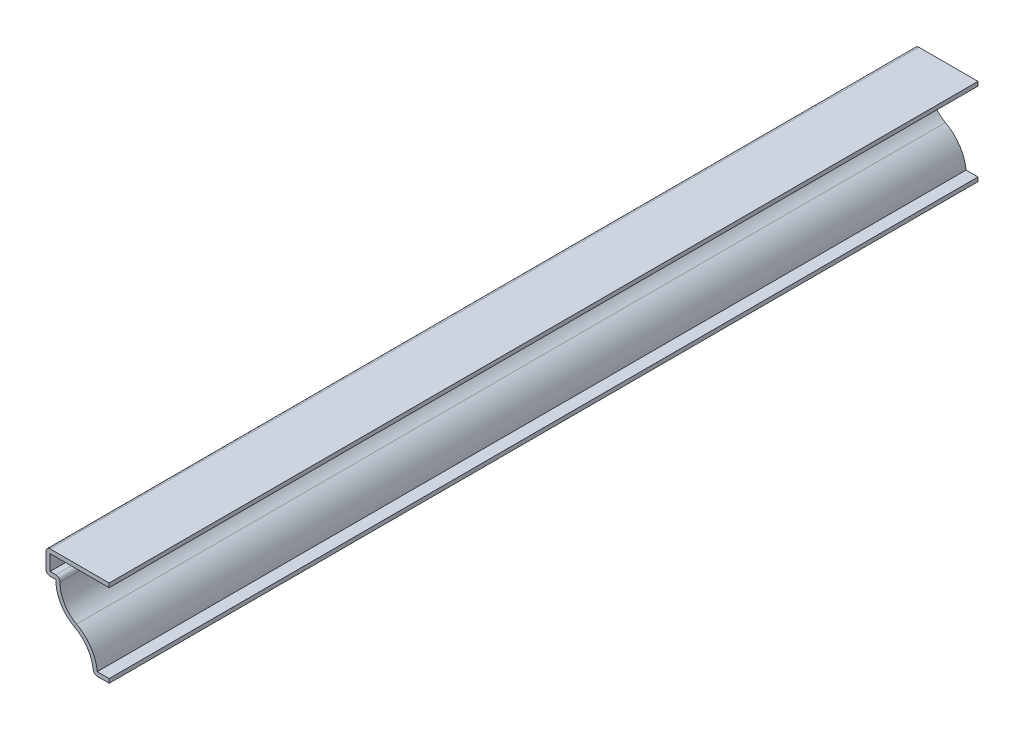
ISO-10303-21;
HEADER;
FILE_DESCRIPTION(('STEP AP214'),'2;1');
FILE_NAME('part.step','',(''),(''),'','','');
FILE_SCHEMA(('AUTOMOTIVE_DESIGN { 1 0 10303 214 1 1 1 1 }'));
ENDSEC;
DATA;
#1=APPLICATION_CONTEXT('core data for automotive mechanical design processes');
#2=APPLICATION_PROTOCOL_DEFINITION('international standard','automotive_design',2000,#1);
#3=PRODUCT_CONTEXT('',#1,'mechanical');
#4=PRODUCT('Part','Part','',(#3));
#5=PRODUCT_RELATED_PRODUCT_CATEGORY('part','',(#4));
#6=PRODUCT_DEFINITION_FORMATION('','',#4);
#7=PRODUCT_DEFINITION_CONTEXT('part definition',#1,'design');
#8=PRODUCT_DEFINITION('design','',#6,#7);
#9=PRODUCT_DEFINITION_SHAPE('','',#8);
#10=(LENGTH_UNIT() NAMED_UNIT(*) SI_UNIT(.MILLI.,.METRE.));
#11=(NAMED_UNIT(*) PLANE_ANGLE_UNIT() SI_UNIT($,.RADIAN.));
#12=(NAMED_UNIT(*) SI_UNIT($,.STERADIAN.) SOLID_ANGLE_UNIT());
#13=UNCERTAINTY_MEASURE_WITH_UNIT(LENGTH_MEASURE(1.E-05),#10,'distance_accuracy_value','');
#14=(GEOMETRIC_REPRESENTATION_CONTEXT(3) GLOBAL_UNCERTAINTY_ASSIGNED_CONTEXT((#13)) GLOBAL_UNIT_ASSIGNED_CONTEXT((#10,
#11,#12)) REPRESENTATION_CONTEXT('',''));
#15=CARTESIAN_POINT('',(0.,0.,0.));
#16=DIRECTION('',(0.,0.,1.));
#17=DIRECTION('',(1.,0.,0.));
#18=AXIS2_PLACEMENT_3D('',#15,#16,#17);
#19=CARTESIAN_POINT('',(0.,0.,-349.25));
#20=DIRECTION('',(0.,-1.,0.));
#21=DIRECTION('',(0.,0.,-1.));
#22=AXIS2_PLACEMENT_3D('',#19,#20,#21);
#23=PLANE('',#22);
#24=DIRECTION('',(1.,0.,0.));
#25=VECTOR('',#24,1.);
#26=CARTESIAN_POINT('',(0.,0.,0.));
#27=LINE('',#26,#25);
#28=CARTESIAN_POINT('',(-4.78474057931869,0.,0.));
#29=VERTEX_POINT('',#28);
#30=CARTESIAN_POINT('',(0.,0.,0.));
#31=VERTEX_POINT('',#30);
#32=EDGE_CURVE('E294',#29,#31,#27,.T.);
#33=ORIENTED_EDGE('',*,*,#32,.F.);
#34=DIRECTION('',(0.,0.,1.));
#35=VECTOR('',#34,1.);
#36=CARTESIAN_POINT('',(-4.78474057931869,0.,-349.25));
#37=LINE('',#36,#35);
#38=CARTESIAN_POINT('',(-4.78474057931869,0.,-349.25));
#39=VERTEX_POINT('',#38);
#40=EDGE_CURVE('E169',#29,#39,#37,.F.);
#41=ORIENTED_EDGE('',*,*,#40,.T.);
#42=DIRECTION('',(1.,0.,0.));
#43=VECTOR('',#42,1.);
#44=CARTESIAN_POINT('',(0.,0.,-349.25));
#45=LINE('',#44,#43);
#46=CARTESIAN_POINT('',(0.,0.,-349.25));
#47=VERTEX_POINT('',#46);
#48=EDGE_CURVE('E162',#39,#47,#45,.T.);
#49=ORIENTED_EDGE('',*,*,#48,.T.);
#50=DIRECTION('',(0.,0.,1.));
#51=VECTOR('',#50,1.);
#52=CARTESIAN_POINT('',(0.,0.,-349.25));
#53=LINE('',#52,#51);
#54=EDGE_CURVE('E166',#47,#31,#53,.T.);
#55=ORIENTED_EDGE('',*,*,#54,.T.);
#56=EDGE_LOOP('',(#33,#41,#49,#55));
#57=FACE_BOUND('',#56,.T.);
#58=ADVANCED_FACE('F35',(#57),#23,.T.);
#59=CARTESIAN_POINT('',(-20.6375,0.,-349.25));
#60=DIRECTION('',(0.,0.,1.));
#61=DIRECTION('',(1.,0.,0.));
#62=AXIS2_PLACEMENT_3D('',#59,#60,#61);
#63=CYLINDRICAL_SURFACE('',#62,14.2875);
#64=CARTESIAN_POINT('',(-20.6375,0.,-349.25));
#65=DIRECTION('',(0.,0.,-1.));
#66=DIRECTION('',(1.,0.,0.));
#67=AXIS2_PLACEMENT_3D('',#64,#65,#66);
#68=CIRCLE('',#67,14.2875);
#69=CARTESIAN_POINT('',(-13.8914032392858,12.5945557581473,-349.25));
#70=VERTEX_POINT('',#69);
#71=CARTESIAN_POINT('',(-6.42685908504664,1.47998007968127,-349.25));
#72=VERTEX_POINT('',#71);
#73=EDGE_CURVE('E186',#70,#72,#68,.T.);
#74=ORIENTED_EDGE('',*,*,#73,.T.);
#75=DIRECTION('',(0.,0.,1.));
#76=VECTOR('',#75,1.);
#77=CARTESIAN_POINT('',(-6.42685908504664,1.47998007968127,-349.25));
#78=LINE('',#77,#76);
#79=CARTESIAN_POINT('',(-6.42685908504664,1.47998007968127,0.));
#80=VERTEX_POINT('',#79);
#81=EDGE_CURVE('E195',#72,#80,#78,.T.);
#82=ORIENTED_EDGE('',*,*,#81,.T.);
#83=CARTESIAN_POINT('',(-20.6375,0.,0.));
#84=DIRECTION('',(0.,0.,-1.));
#85=DIRECTION('',(1.,0.,0.));
#86=AXIS2_PLACEMENT_3D('',#83,#84,#85);
#87=CIRCLE('',#86,14.2875);
#88=CARTESIAN_POINT('',(-13.8914032392858,12.5945557581473,0.));
#89=VERTEX_POINT('',#88);
#90=EDGE_CURVE('E172',#89,#80,#87,.T.);
#91=ORIENTED_EDGE('',*,*,#90,.F.);
#92=DIRECTION('',(0.,0.,1.));
#93=VECTOR('',#92,1.);
#94=CARTESIAN_POINT('',(-13.8914032392858,12.5945557581473,-349.25));
#95=LINE('',#94,#93);
#96=EDGE_CURVE('E199',#70,#89,#95,.T.);
#97=ORIENTED_EDGE('',*,*,#96,.F.);
#98=EDGE_LOOP('',(#74,#82,#91,#97));
#99=FACE_BOUND('',#98,.T.);
#100=ADVANCED_FACE('F343',(#99),#63,.F.);
#101=CARTESIAN_POINT('',(-7.14530647857166,25.1891115162946,-349.25));
#102=DIRECTION('',(0.,0.,1.));
#103=DIRECTION('',(1.,0.,0.));
#104=AXIS2_PLACEMENT_3D('',#101,#102,#103);
#105=CYLINDRICAL_SURFACE('',#104,14.2875);
#106=CARTESIAN_POINT('',(-7.14530647857166,25.1891115162946,0.));
#107=DIRECTION('',(0.,0.,1.));
#108=DIRECTION('',(-1.,0.,0.));
#109=AXIS2_PLACEMENT_3D('',#106,#107,#108);
#110=CIRCLE('',#109,14.2875);
#111=CARTESIAN_POINT('',(-21.43125,25.4,0.));
#112=VERTEX_POINT('',#111);
#113=EDGE_CURVE('E255',#112,#89,#110,.T.);
#114=ORIENTED_EDGE('',*,*,#113,.F.);
#115=DIRECTION('',(0.,0.,1.));
#116=VECTOR('',#115,1.);
#117=CARTESIAN_POINT('',(-21.43125,25.4,-349.25));
#118=LINE('',#117,#116);
#119=CARTESIAN_POINT('',(-21.43125,25.4,-349.25));
#120=VERTEX_POINT('',#119);
#121=EDGE_CURVE('E265',#120,#112,#118,.T.);
#122=ORIENTED_EDGE('',*,*,#121,.F.);
#123=CARTESIAN_POINT('',(-7.14530647857166,25.1891115162946,-349.25));
#124=DIRECTION('',(0.,0.,1.));
#125=DIRECTION('',(-1.,0.,0.));
#126=AXIS2_PLACEMENT_3D('',#123,#124,#125);
#127=CIRCLE('',#126,14.2875);
#128=EDGE_CURVE('E191',#120,#70,#127,.T.);
#129=ORIENTED_EDGE('',*,*,#128,.T.);
#130=ORIENTED_EDGE('',*,*,#96,.T.);
#131=EDGE_LOOP('',(#114,#122,#129,#130));
#132=FACE_BOUND('',#131,.T.);
#133=ADVANCED_FACE('F347',(#132),#105,.T.);
#134=CARTESIAN_POINT('',(-25.4,25.4,-349.25));
#135=DIRECTION('',(0.,-1.,0.));
#136=DIRECTION('',(1.,0.,0.));
#137=AXIS2_PLACEMENT_3D('',#134,#135,#136);
#138=PLANE('',#137);
#139=DIRECTION('',(1.,0.,0.));
#140=VECTOR('',#139,1.);
#141=CARTESIAN_POINT('',(-25.4,25.4,0.));
#142=LINE('',#141,#140);
#143=CARTESIAN_POINT('',(-23.749,25.4,0.));
#144=VERTEX_POINT('',#143);
#145=EDGE_CURVE('E231',#144,#112,#142,.T.);
#146=ORIENTED_EDGE('',*,*,#145,.F.);
#147=DIRECTION('',(0.,0.,1.));
#148=VECTOR('',#147,1.);
#149=CARTESIAN_POINT('',(-23.749,25.4,-349.25));
#150=LINE('',#149,#148);
#151=CARTESIAN_POINT('',(-23.749,25.4,-349.25));
#152=VERTEX_POINT('',#151);
#153=EDGE_CURVE('E43',#144,#152,#150,.F.);
#154=ORIENTED_EDGE('',*,*,#153,.T.);
#155=DIRECTION('',(1.,0.,0.));
#156=VECTOR('',#155,1.);
#157=CARTESIAN_POINT('',(-25.4,25.4,-349.25));
#158=LINE('',#157,#156);
#159=EDGE_CURVE('E229',#152,#120,#158,.T.);
#160=ORIENTED_EDGE('',*,*,#159,.T.);
#161=ORIENTED_EDGE('',*,*,#121,.T.);
#162=EDGE_LOOP('',(#146,#154,#160,#161));
#163=FACE_BOUND('',#162,.T.);
#164=ADVANCED_FACE('F227',(#163),#138,.T.);
#165=CARTESIAN_POINT('',(-25.4,34.925,-349.25));
#166=DIRECTION('',(-1.,0.,0.));
#167=DIRECTION('',(0.,0.,1.));
#168=AXIS2_PLACEMENT_3D('',#165,#166,#167);
#169=PLANE('',#168);
#170=DIRECTION('',(0.,-1.,0.));
#171=VECTOR('',#170,1.);
#172=CARTESIAN_POINT('',(-25.4,34.925,-349.25));
#173=LINE('',#172,#171);
#174=CARTESIAN_POINT('',(-25.4,33.274,-349.25));
#175=VERTEX_POINT('',#174);
#176=CARTESIAN_POINT('',(-25.4,27.051,-349.25));
#177=VERTEX_POINT('',#176);
#178=EDGE_CURVE('E239',#175,#177,#173,.T.);
#179=ORIENTED_EDGE('',*,*,#178,.T.);
#180=DIRECTION('',(0.,0.,1.));
#181=VECTOR('',#180,1.);
#182=CARTESIAN_POINT('',(-25.4,27.051,-349.25));
#183=LINE('',#182,#181);
#184=CARTESIAN_POINT('',(-25.4,27.051,0.));
#185=VERTEX_POINT('',#184);
#186=EDGE_CURVE('E221',#177,#185,#183,.T.);
#187=ORIENTED_EDGE('',*,*,#186,.T.);
#188=DIRECTION('',(0.,-1.,0.));
#189=VECTOR('',#188,1.);
#190=CARTESIAN_POINT('',(-25.4,34.925,0.));
#191=LINE('',#190,#189);
#192=CARTESIAN_POINT('',(-25.4,33.274,0.));
#193=VERTEX_POINT('',#192);
#194=EDGE_CURVE('E247',#193,#185,#191,.T.);
#195=ORIENTED_EDGE('',*,*,#194,.F.);
#196=DIRECTION('',(0.,0.,1.));
#197=VECTOR('',#196,1.);
#198=CARTESIAN_POINT('',(-25.4,33.274,-349.25));
#199=LINE('',#198,#197);
#200=EDGE_CURVE('E219',#193,#175,#199,.F.);
#201=ORIENTED_EDGE('',*,*,#200,.T.);
#202=EDGE_LOOP('',(#179,#187,#195,#201));
#203=FACE_BOUND('',#202,.T.);
#204=ADVANCED_FACE('F246',(#203),#169,.T.);
#205=CARTESIAN_POINT('',(0.,34.925,-349.25));
#206=DIRECTION('',(0.,1.,0.));
#207=DIRECTION('',(0.,0.,1.));
#208=AXIS2_PLACEMENT_3D('',#205,#206,#207);
#209=PLANE('',#208);
#210=DIRECTION('',(-1.,0.,0.));
#211=VECTOR('',#210,1.);
#212=CARTESIAN_POINT('',(0.,34.925,-349.25));
#213=LINE('',#212,#211);
#214=CARTESIAN_POINT('',(0.,34.925,-349.25));
#215=VERTEX_POINT('',#214);
#216=CARTESIAN_POINT('',(-23.749,34.925,-349.25));
#217=VERTEX_POINT('',#216);
#218=EDGE_CURVE('E335',#215,#217,#213,.T.);
#219=ORIENTED_EDGE('',*,*,#218,.T.);
#220=DIRECTION('',(0.,0.,1.));
#221=VECTOR('',#220,1.);
#222=CARTESIAN_POINT('',(-23.749,34.925,-349.25));
#223=LINE('',#222,#221);
#224=CARTESIAN_POINT('',(-23.749,34.925,0.));
#225=VERTEX_POINT('',#224);
#226=EDGE_CURVE('E11',#217,#225,#223,.T.);
#227=ORIENTED_EDGE('',*,*,#226,.T.);
#228=DIRECTION('',(-1.,0.,0.));
#229=VECTOR('',#228,1.);
#230=CARTESIAN_POINT('',(0.,34.925,0.));
#231=LINE('',#230,#229);
#232=CARTESIAN_POINT('',(0.,34.925,0.));
#233=VERTEX_POINT('',#232);
#234=EDGE_CURVE('E253',#233,#225,#231,.T.);
#235=ORIENTED_EDGE('',*,*,#234,.F.);
#236=DIRECTION('',(0.,0.,1.));
#237=VECTOR('',#236,1.);
#238=CARTESIAN_POINT('',(0.,34.925,-349.25));
#239=LINE('',#238,#237);
#240=EDGE_CURVE('E267',#215,#233,#239,.T.);
#241=ORIENTED_EDGE('',*,*,#240,.F.);
#242=EDGE_LOOP('',(#219,#227,#235,#241));
#243=FACE_BOUND('',#242,.T.);
#244=ADVANCED_FACE('F379',(#243),#209,.T.);
#245=CARTESIAN_POINT('',(0.,34.925,-349.25));
#246=DIRECTION('',(-1.,0.,0.));
#247=DIRECTION('',(0.,0.,1.));
#248=AXIS2_PLACEMENT_3D('',#245,#246,#247);
#249=PLANE('',#248);
#250=DIRECTION('',(0.,-1.,0.));
#251=VECTOR('',#250,1.);
#252=CARTESIAN_POINT('',(0.,34.925,0.));
#253=LINE('',#252,#251);
#254=CARTESIAN_POINT('',(0.,33.274,0.));
#255=VERTEX_POINT('',#254);
#256=EDGE_CURVE('E257',#233,#255,#253,.T.);
#257=ORIENTED_EDGE('',*,*,#256,.T.);
#258=DIRECTION('',(0.,0.,1.));
#259=VECTOR('',#258,1.);
#260=CARTESIAN_POINT('',(0.,33.274,-349.25));
#261=LINE('',#260,#259);
#262=CARTESIAN_POINT('',(0.,33.274,-349.25));
#263=VERTEX_POINT('',#262);
#264=EDGE_CURVE('E269',#263,#255,#261,.T.);
#265=ORIENTED_EDGE('',*,*,#264,.F.);
#266=DIRECTION('',(0.,-1.,0.));
#267=VECTOR('',#266,1.);
#268=CARTESIAN_POINT('',(0.,34.925,-349.25));
#269=LINE('',#268,#267);
#270=EDGE_CURVE('E333',#215,#263,#269,.T.);
#271=ORIENTED_EDGE('',*,*,#270,.F.);
#272=ORIENTED_EDGE('',*,*,#240,.T.);
#273=EDGE_LOOP('',(#257,#265,#271,#272));
#274=FACE_BOUND('',#273,.T.);
#275=ADVANCED_FACE('F307',(#274),#249,.F.);
#276=CARTESIAN_POINT('',(0.,33.274,-349.25));
#277=DIRECTION('',(0.,1.,0.));
#278=DIRECTION('',(0.,0.,1.));
#279=AXIS2_PLACEMENT_3D('',#276,#277,#278);
#280=PLANE('',#279);
#281=DIRECTION('',(1.,0.,0.));
#282=VECTOR('',#281,1.);
#283=CARTESIAN_POINT('',(0.,33.274,0.));
#284=LINE('',#283,#282);
#285=CARTESIAN_POINT('',(-23.749,33.274,0.));
#286=VERTEX_POINT('',#285);
#287=EDGE_CURVE('E303',#255,#286,#284,.F.);
#288=ORIENTED_EDGE('',*,*,#287,.T.);
#289=DIRECTION('',(0.,0.,1.));
#290=VECTOR('',#289,1.);
#291=CARTESIAN_POINT('',(-23.749,33.274,-349.25));
#292=LINE('',#291,#290);
#293=CARTESIAN_POINT('',(-23.749,33.274,-349.25));
#294=VERTEX_POINT('',#293);
#295=EDGE_CURVE('E272',#294,#286,#292,.T.);
#296=ORIENTED_EDGE('',*,*,#295,.F.);
#297=DIRECTION('',(1.,0.,0.));
#298=VECTOR('',#297,1.);
#299=CARTESIAN_POINT('',(0.,33.274,-349.25));
#300=LINE('',#299,#298);
#301=EDGE_CURVE('E315',#263,#294,#300,.F.);
#302=ORIENTED_EDGE('',*,*,#301,.F.);
#303=ORIENTED_EDGE('',*,*,#264,.T.);
#304=EDGE_LOOP('',(#288,#296,#302,#303));
#305=FACE_BOUND('',#304,.T.);
#306=ADVANCED_FACE('F313',(#305),#280,.F.);
#307=CARTESIAN_POINT('',(-23.749,34.925,-349.25));
#308=DIRECTION('',(-1.,0.,0.));
#309=DIRECTION('',(0.,0.,1.));
#310=AXIS2_PLACEMENT_3D('',#307,#308,#309);
#311=PLANE('',#310);
#312=DIRECTION('',(0.,1.,0.));
#313=VECTOR('',#312,1.);
#314=CARTESIAN_POINT('',(-23.749,34.925,0.));
#315=LINE('',#314,#313);
#316=CARTESIAN_POINT('',(-23.749,27.051,0.));
#317=VERTEX_POINT('',#316);
#318=EDGE_CURVE('E301',#286,#317,#315,.F.);
#319=ORIENTED_EDGE('',*,*,#318,.T.);
#320=DIRECTION('',(0.,0.,1.));
#321=VECTOR('',#320,1.);
#322=CARTESIAN_POINT('',(-23.749,27.051,-349.25));
#323=LINE('',#322,#321);
#324=CARTESIAN_POINT('',(-23.749,27.051,-349.25));
#325=VERTEX_POINT('',#324);
#326=EDGE_CURVE('E275',#325,#317,#323,.T.);
#327=ORIENTED_EDGE('',*,*,#326,.F.);
#328=DIRECTION('',(0.,1.,0.));
#329=VECTOR('',#328,1.);
#330=CARTESIAN_POINT('',(-23.749,34.925,-349.25));
#331=LINE('',#330,#329);
#332=EDGE_CURVE('E324',#294,#325,#331,.F.);
#333=ORIENTED_EDGE('',*,*,#332,.F.);
#334=ORIENTED_EDGE('',*,*,#295,.T.);
#335=EDGE_LOOP('',(#319,#327,#333,#334));
#336=FACE_BOUND('',#335,.T.);
#337=ADVANCED_FACE('F320',(#336),#311,.F.);
#338=CARTESIAN_POINT('',(-25.4,27.051,-349.25));
#339=DIRECTION('',(0.,-1.,0.));
#340=DIRECTION('',(1.,0.,0.));
#341=AXIS2_PLACEMENT_3D('',#338,#339,#340);
#342=PLANE('',#341);
#343=DIRECTION('',(1.,0.,0.));
#344=VECTOR('',#343,1.);
#345=CARTESIAN_POINT('',(-25.4,27.051,0.));
#346=LINE('',#345,#344);
#347=CARTESIAN_POINT('',(-21.43125,27.051,0.));
#348=VERTEX_POINT('',#347);
#349=EDGE_CURVE('E299',#317,#348,#346,.T.);
#350=ORIENTED_EDGE('',*,*,#349,.T.);
#351=DIRECTION('',(0.,0.,1.));
#352=VECTOR('',#351,1.);
#353=CARTESIAN_POINT('',(-21.43125,27.051,-349.25));
#354=LINE('',#353,#352);
#355=CARTESIAN_POINT('',(-21.43125,27.051,-349.25));
#356=VERTEX_POINT('',#355);
#357=EDGE_CURVE('E58',#348,#356,#354,.F.);
#358=ORIENTED_EDGE('',*,*,#357,.T.);
#359=DIRECTION('',(1.,0.,0.));
#360=VECTOR('',#359,1.);
#361=CARTESIAN_POINT('',(-25.4,27.051,-349.25));
#362=LINE('',#361,#360);
#363=EDGE_CURVE('E323',#325,#356,#362,.T.);
#364=ORIENTED_EDGE('',*,*,#363,.F.);
#365=ORIENTED_EDGE('',*,*,#326,.T.);
#366=EDGE_LOOP('',(#350,#358,#364,#365));
#367=FACE_BOUND('',#366,.T.);
#368=ADVANCED_FACE('F322',(#367),#342,.F.);
#369=CARTESIAN_POINT('',(-7.14530647857166,25.1891115162946,-349.25));
#370=DIRECTION('',(0.,0.,1.));
#371=DIRECTION('',(1.,0.,0.));
#372=AXIS2_PLACEMENT_3D('',#369,#370,#371);
#373=CYLINDRICAL_SURFACE('',#372,12.6365);
#374=CARTESIAN_POINT('',(-7.14530647857166,25.1891115162946,-349.25));
#375=DIRECTION('',(0.,0.,1.));
#376=DIRECTION('',(1.,0.,0.));
#377=AXIS2_PLACEMENT_3D('',#374,#375,#376);
#378=CIRCLE('',#377,12.6365);
#379=CARTESIAN_POINT('',(-19.7804298597461,25.3756306641052,-349.25));
#380=VERTEX_POINT('',#379);
#381=CARTESIAN_POINT('',(-13.11185428027,14.0499266457554,-349.25));
#382=VERTEX_POINT('',#381);
#383=EDGE_CURVE('E325',#380,#382,#378,.T.);
#384=ORIENTED_EDGE('',*,*,#383,.F.);
#385=DIRECTION('',(0.,0.,1.));
#386=VECTOR('',#385,1.);
#387=CARTESIAN_POINT('',(-19.7804298597461,25.3756306641052,-349.25));
#388=LINE('',#387,#386);
#389=CARTESIAN_POINT('',(-19.7804298597461,25.3756306641052,0.));
#390=VERTEX_POINT('',#389);
#391=EDGE_CURVE('E215',#380,#390,#388,.T.);
#392=ORIENTED_EDGE('',*,*,#391,.T.);
#393=CARTESIAN_POINT('',(-7.14530647857166,25.1891115162946,0.));
#394=DIRECTION('',(0.,0.,1.));
#395=DIRECTION('',(1.,0.,0.));
#396=AXIS2_PLACEMENT_3D('',#393,#394,#395);
#397=CIRCLE('',#396,12.6365);
#398=CARTESIAN_POINT('',(-13.11185428027,14.0499266457554,0.));
#399=VERTEX_POINT('',#398);
#400=EDGE_CURVE('E292',#390,#399,#397,.T.);
#401=ORIENTED_EDGE('',*,*,#400,.T.);
#402=DIRECTION('',(0.,0.,1.));
#403=VECTOR('',#402,1.);
#404=CARTESIAN_POINT('',(-13.11185428027,14.0499266457554,-349.25));
#405=LINE('',#404,#403);
#406=EDGE_CURVE('E278',#382,#399,#405,.T.);
#407=ORIENTED_EDGE('',*,*,#406,.F.);
#408=EDGE_LOOP('',(#384,#392,#401,#407));
#409=FACE_BOUND('',#408,.T.);
#410=ADVANCED_FACE('F395',(#409),#373,.F.);
#411=CARTESIAN_POINT('',(-20.6375,0.,-349.25));
#412=DIRECTION('',(0.,0.,1.));
#413=DIRECTION('',(1.,0.,0.));
#414=AXIS2_PLACEMENT_3D('',#411,#412,#413);
#415=CYLINDRICAL_SURFACE('',#414,15.9385);
#416=CARTESIAN_POINT('',(-20.6375,0.,0.));
#417=DIRECTION('',(0.,0.,1.));
#418=DIRECTION('',(1.,0.,0.));
#419=AXIS2_PLACEMENT_3D('',#416,#417,#418);
#420=CIRCLE('',#419,15.9385);
#421=CARTESIAN_POINT('',(-4.7847405793187,1.651,0.));
#422=VERTEX_POINT('',#421);
#423=EDGE_CURVE('E290',#399,#422,#420,.F.);
#424=ORIENTED_EDGE('',*,*,#423,.T.);
#425=DIRECTION('',(0.,0.,1.));
#426=VECTOR('',#425,1.);
#427=CARTESIAN_POINT('',(-4.7847405793187,1.651,-349.25));
#428=LINE('',#427,#426);
#429=CARTESIAN_POINT('',(-4.7847405793187,1.651,-349.25));
#430=VERTEX_POINT('',#429);
#431=EDGE_CURVE('E188',#430,#422,#428,.T.);
#432=ORIENTED_EDGE('',*,*,#431,.F.);
#433=CARTESIAN_POINT('',(-20.6375,0.,-349.25));
#434=DIRECTION('',(0.,0.,1.));
#435=DIRECTION('',(1.,0.,0.));
#436=AXIS2_PLACEMENT_3D('',#433,#434,#435);
#437=CIRCLE('',#436,15.9385);
#438=EDGE_CURVE('E328',#382,#430,#437,.F.);
#439=ORIENTED_EDGE('',*,*,#438,.F.);
#440=ORIENTED_EDGE('',*,*,#406,.T.);
#441=EDGE_LOOP('',(#424,#432,#439,#440));
#442=FACE_BOUND('',#441,.T.);
#443=ADVANCED_FACE('F398',(#442),#415,.T.);
#444=CARTESIAN_POINT('',(0.,1.651,-349.25));
#445=DIRECTION('',(0.,-1.,0.));
#446=DIRECTION('',(0.,0.,-1.));
#447=AXIS2_PLACEMENT_3D('',#444,#445,#446);
#448=PLANE('',#447);
#449=DIRECTION('',(1.,0.,0.));
#450=VECTOR('',#449,1.);
#451=CARTESIAN_POINT('',(0.,1.651,0.));
#452=LINE('',#451,#450);
#453=CARTESIAN_POINT('',(0.,1.651,0.));
#454=VERTEX_POINT('',#453);
#455=EDGE_CURVE('E285',#422,#454,#452,.T.);
#456=ORIENTED_EDGE('',*,*,#455,.T.);
#457=DIRECTION('',(0.,0.,1.));
#458=VECTOR('',#457,1.);
#459=CARTESIAN_POINT('',(0.,1.651,-349.25));
#460=LINE('',#459,#458);
#461=CARTESIAN_POINT('',(0.,1.651,-349.25));
#462=VERTEX_POINT('',#461);
#463=EDGE_CURVE('E185',#462,#454,#460,.T.);
#464=ORIENTED_EDGE('',*,*,#463,.F.);
#465=DIRECTION('',(1.,0.,0.));
#466=VECTOR('',#465,1.);
#467=CARTESIAN_POINT('',(0.,1.651,-349.25));
#468=LINE('',#467,#466);
#469=EDGE_CURVE('E177',#430,#462,#468,.T.);
#470=ORIENTED_EDGE('',*,*,#469,.F.);
#471=ORIENTED_EDGE('',*,*,#431,.T.);
#472=EDGE_LOOP('',(#456,#464,#470,#471));
#473=FACE_BOUND('',#472,.T.);
#474=ADVANCED_FACE('F284',(#473),#448,.F.);
#475=CARTESIAN_POINT('',(0.,1.651,-349.25));
#476=DIRECTION('',(-1.,0.,0.));
#477=DIRECTION('',(0.,0.,1.));
#478=AXIS2_PLACEMENT_3D('',#475,#476,#477);
#479=PLANE('',#478);
#480=DIRECTION('',(0.,-1.,0.));
#481=VECTOR('',#480,1.);
#482=CARTESIAN_POINT('',(0.,1.651,0.));
#483=LINE('',#482,#481);
#484=EDGE_CURVE('E184',#454,#31,#483,.T.);
#485=ORIENTED_EDGE('',*,*,#484,.T.);
#486=ORIENTED_EDGE('',*,*,#54,.F.);
#487=DIRECTION('',(0.,-1.,0.));
#488=VECTOR('',#487,1.);
#489=CARTESIAN_POINT('',(0.,1.651,-349.25));
#490=LINE('',#489,#488);
#491=EDGE_CURVE('E171',#462,#47,#490,.T.);
#492=ORIENTED_EDGE('',*,*,#491,.F.);
#493=ORIENTED_EDGE('',*,*,#463,.T.);
#494=EDGE_LOOP('',(#485,#486,#492,#493));
#495=FACE_BOUND('',#494,.T.);
#496=ADVANCED_FACE('F182',(#495),#479,.F.);
#497=CARTESIAN_POINT('',(-20.6375,0.,-349.25));
#498=DIRECTION('',(0.,0.,1.));
#499=DIRECTION('',(1.,0.,0.));
#500=AXIS2_PLACEMENT_3D('',#497,#498,#499);
#501=PLANE('',#500);
#502=ORIENTED_EDGE('',*,*,#48,.F.);
#503=CARTESIAN_POINT('',(-4.78474057931869,1.651,-349.25));
#504=DIRECTION('',(0.,0.,1.));
#505=DIRECTION('',(1.,0.,0.));
#506=AXIS2_PLACEMENT_3D('',#503,#504,#505);
#507=CIRCLE('',#506,1.651);
#508=EDGE_CURVE('E213',#39,#72,#507,.F.);
#509=ORIENTED_EDGE('',*,*,#508,.T.);
#510=ORIENTED_EDGE('',*,*,#73,.F.);
#511=ORIENTED_EDGE('',*,*,#128,.F.);
#512=ORIENTED_EDGE('',*,*,#159,.F.);
#513=CARTESIAN_POINT('',(-23.749,27.051,-349.25));
#514=DIRECTION('',(0.,0.,1.));
#515=DIRECTION('',(1.,0.,0.));
#516=AXIS2_PLACEMENT_3D('',#513,#514,#515);
#517=CIRCLE('',#516,1.651);
#518=EDGE_CURVE('E210',#152,#177,#517,.F.);
#519=ORIENTED_EDGE('',*,*,#518,.T.);
#520=ORIENTED_EDGE('',*,*,#178,.F.);
#521=CARTESIAN_POINT('',(-23.749,33.274,-349.25));
#522=DIRECTION('',(0.,0.,1.));
#523=DIRECTION('',(1.,0.,0.));
#524=AXIS2_PLACEMENT_3D('',#521,#522,#523);
#525=CIRCLE('',#524,1.651);
#526=EDGE_CURVE('E208',#175,#217,#525,.F.);
#527=ORIENTED_EDGE('',*,*,#526,.T.);
#528=ORIENTED_EDGE('',*,*,#218,.F.);
#529=ORIENTED_EDGE('',*,*,#270,.T.);
#530=ORIENTED_EDGE('',*,*,#301,.T.);
#531=ORIENTED_EDGE('',*,*,#332,.T.);
#532=ORIENTED_EDGE('',*,*,#363,.T.);
#533=CARTESIAN_POINT('',(-21.43125,25.4,-349.25));
#534=DIRECTION('',(0.,0.,1.));
#535=DIRECTION('',(1.,0.,0.));
#536=AXIS2_PLACEMENT_3D('',#533,#534,#535);
#537=CIRCLE('',#536,1.651);
#538=EDGE_CURVE('E50',#356,#380,#537,.F.);
#539=ORIENTED_EDGE('',*,*,#538,.T.);
#540=ORIENTED_EDGE('',*,*,#383,.T.);
#541=ORIENTED_EDGE('',*,*,#438,.T.);
#542=ORIENTED_EDGE('',*,*,#469,.T.);
#543=ORIENTED_EDGE('',*,*,#491,.T.);
#544=EDGE_LOOP('',(#502,#509,#510,#511,#512,#519,#520,#527,#528,#529,#530,#531,#532,#539,#540,
#541,#542,#543));
#545=FACE_BOUND('',#544,.T.);
#546=ADVANCED_FACE('F175',(#545),#501,.F.);
#547=CARTESIAN_POINT('',(-20.6375,0.,0.));
#548=DIRECTION('',(0.,0.,1.));
#549=DIRECTION('',(1.,0.,0.));
#550=AXIS2_PLACEMENT_3D('',#547,#548,#549);
#551=PLANE('',#550);
#552=ORIENTED_EDGE('',*,*,#90,.T.);
#553=CARTESIAN_POINT('',(-4.78474057931869,1.651,0.));
#554=DIRECTION('',(0.,0.,1.));
#555=DIRECTION('',(1.,0.,0.));
#556=AXIS2_PLACEMENT_3D('',#553,#554,#555);
#557=CIRCLE('',#556,1.651);
#558=EDGE_CURVE('E205',#80,#29,#557,.T.);
#559=ORIENTED_EDGE('',*,*,#558,.T.);
#560=ORIENTED_EDGE('',*,*,#32,.T.);
#561=ORIENTED_EDGE('',*,*,#484,.F.);
#562=ORIENTED_EDGE('',*,*,#455,.F.);
#563=ORIENTED_EDGE('',*,*,#423,.F.);
#564=ORIENTED_EDGE('',*,*,#400,.F.);
#565=CARTESIAN_POINT('',(-21.43125,25.4,0.));
#566=DIRECTION('',(0.,0.,1.));
#567=DIRECTION('',(1.,0.,0.));
#568=AXIS2_PLACEMENT_3D('',#565,#566,#567);
#569=CIRCLE('',#568,1.651);
#570=EDGE_CURVE('E203',#390,#348,#569,.T.);
#571=ORIENTED_EDGE('',*,*,#570,.T.);
#572=ORIENTED_EDGE('',*,*,#349,.F.);
#573=ORIENTED_EDGE('',*,*,#318,.F.);
#574=ORIENTED_EDGE('',*,*,#287,.F.);
#575=ORIENTED_EDGE('',*,*,#256,.F.);
#576=ORIENTED_EDGE('',*,*,#234,.T.);
#577=CARTESIAN_POINT('',(-23.749,33.274,0.));
#578=DIRECTION('',(0.,0.,1.));
#579=DIRECTION('',(1.,0.,0.));
#580=AXIS2_PLACEMENT_3D('',#577,#578,#579);
#581=CIRCLE('',#580,1.651);
#582=EDGE_CURVE('E198',#225,#193,#581,.T.);
#583=ORIENTED_EDGE('',*,*,#582,.T.);
#584=ORIENTED_EDGE('',*,*,#194,.T.);
#585=CARTESIAN_POINT('',(-23.749,27.051,0.));
#586=DIRECTION('',(0.,0.,1.));
#587=DIRECTION('',(1.,0.,0.));
#588=AXIS2_PLACEMENT_3D('',#585,#586,#587);
#589=CIRCLE('',#588,1.651);
#590=EDGE_CURVE('E201',#185,#144,#589,.T.);
#591=ORIENTED_EDGE('',*,*,#590,.T.);
#592=ORIENTED_EDGE('',*,*,#145,.T.);
#593=ORIENTED_EDGE('',*,*,#113,.T.);
#594=EDGE_LOOP('',(#552,#559,#560,#561,#562,#563,#564,#571,#572,#573,#574,#575,#576,#583,#584,
#591,#592,#593));
#595=FACE_BOUND('',#594,.T.);
#596=ADVANCED_FACE('F251',(#595),#551,.T.);
#597=CARTESIAN_POINT('',(-4.78474057931869,1.651,-349.25));
#598=DIRECTION('',(0.,0.,1.));
#599=DIRECTION('',(1.,0.,0.));
#600=AXIS2_PLACEMENT_3D('',#597,#598,#599);
#601=CYLINDRICAL_SURFACE('',#600,1.651);
#602=ORIENTED_EDGE('',*,*,#508,.F.);
#603=ORIENTED_EDGE('',*,*,#40,.F.);
#604=ORIENTED_EDGE('',*,*,#558,.F.);
#605=ORIENTED_EDGE('',*,*,#81,.F.);
#606=EDGE_LOOP('',(#602,#603,#604,#605));
#607=FACE_BOUND('',#606,.T.);
#608=ADVANCED_FACE('F340',(#607),#601,.T.);
#609=CARTESIAN_POINT('',(-21.43125,25.4,-349.25));
#610=DIRECTION('',(0.,0.,1.));
#611=DIRECTION('',(1.,0.,0.));
#612=AXIS2_PLACEMENT_3D('',#609,#610,#611);
#613=CYLINDRICAL_SURFACE('',#612,1.651);
#614=ORIENTED_EDGE('',*,*,#538,.F.);
#615=ORIENTED_EDGE('',*,*,#357,.F.);
#616=ORIENTED_EDGE('',*,*,#570,.F.);
#617=ORIENTED_EDGE('',*,*,#391,.F.);
#618=EDGE_LOOP('',(#614,#615,#616,#617));
#619=FACE_BOUND('',#618,.T.);
#620=ADVANCED_FACE('F365',(#619),#613,.T.);
#621=CARTESIAN_POINT('',(-23.749,27.051,-349.25));
#622=DIRECTION('',(0.,0.,1.));
#623=DIRECTION('',(1.,0.,0.));
#624=AXIS2_PLACEMENT_3D('',#621,#622,#623);
#625=CYLINDRICAL_SURFACE('',#624,1.651);
#626=ORIENTED_EDGE('',*,*,#518,.F.);
#627=ORIENTED_EDGE('',*,*,#153,.F.);
#628=ORIENTED_EDGE('',*,*,#590,.F.);
#629=ORIENTED_EDGE('',*,*,#186,.F.);
#630=EDGE_LOOP('',(#626,#627,#628,#629));
#631=FACE_BOUND('',#630,.T.);
#632=ADVANCED_FACE('F242',(#631),#625,.T.);
#633=CARTESIAN_POINT('',(-23.749,33.274,-349.25));
#634=DIRECTION('',(0.,0.,1.));
#635=DIRECTION('',(1.,0.,0.));
#636=AXIS2_PLACEMENT_3D('',#633,#634,#635);
#637=CYLINDRICAL_SURFACE('',#636,1.651);
#638=ORIENTED_EDGE('',*,*,#526,.F.);
#639=ORIENTED_EDGE('',*,*,#200,.F.);
#640=ORIENTED_EDGE('',*,*,#582,.F.);
#641=ORIENTED_EDGE('',*,*,#226,.F.);
#642=EDGE_LOOP('',(#638,#639,#640,#641));
#643=FACE_BOUND('',#642,.T.);
#644=ADVANCED_FACE('F37',(#643),#637,.T.);
#645=CLOSED_SHELL('',(#58,#100,#133,#164,#204,#244,#275,#306,#337,#368,#410,#443,#474,#496,#546,
#596,#608,#620,#632,#644));
#646=MANIFOLD_SOLID_BREP('B2',#645);
#647=ADVANCED_BREP_SHAPE_REPRESENTATION('',(#18,#646),#14);
#648=SHAPE_DEFINITION_REPRESENTATION(#9,#647);
ENDSEC;
END-ISO-10303-21;
